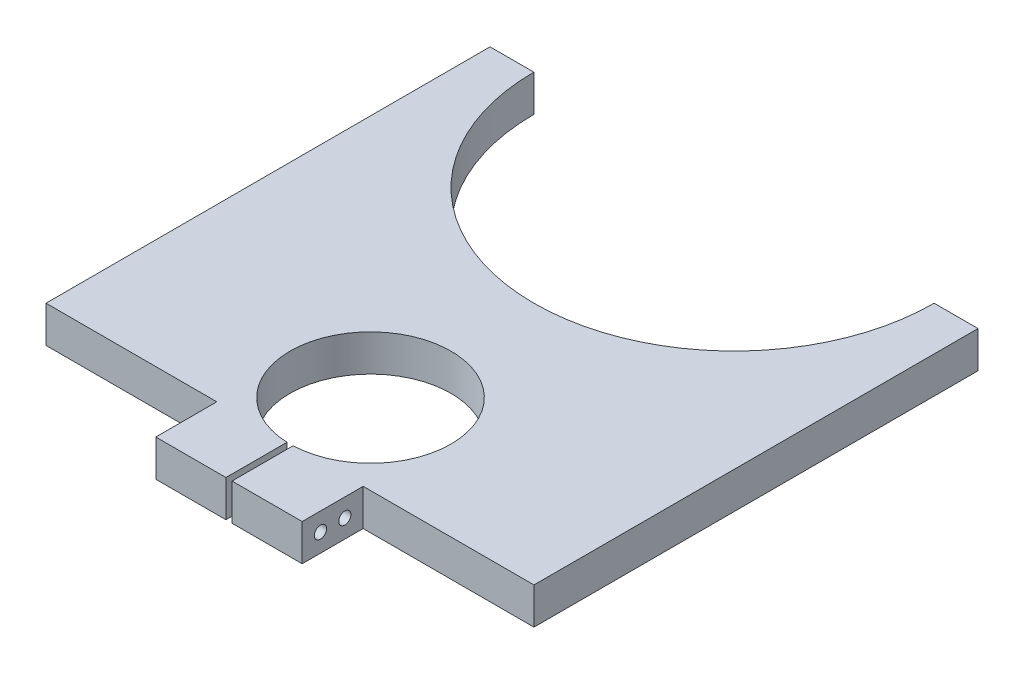
ISO-10303-21;
HEADER;
FILE_DESCRIPTION(('STEP AP214'),'2;1');
FILE_NAME('part.step','',(''),(''),'','','');
FILE_SCHEMA(('AUTOMOTIVE_DESIGN { 1 0 10303 214 1 1 1 1 }'));
ENDSEC;
DATA;
#1=APPLICATION_CONTEXT('core data for automotive mechanical design processes');
#2=APPLICATION_PROTOCOL_DEFINITION('international standard','automotive_design',2000,#1);
#3=PRODUCT_CONTEXT('',#1,'mechanical');
#4=PRODUCT('Part','Part','',(#3));
#5=PRODUCT_RELATED_PRODUCT_CATEGORY('part','',(#4));
#6=PRODUCT_DEFINITION_FORMATION('','',#4);
#7=PRODUCT_DEFINITION_CONTEXT('part definition',#1,'design');
#8=PRODUCT_DEFINITION('design','',#6,#7);
#9=PRODUCT_DEFINITION_SHAPE('','',#8);
#10=(LENGTH_UNIT() NAMED_UNIT(*) SI_UNIT(.MILLI.,.METRE.));
#11=(NAMED_UNIT(*) PLANE_ANGLE_UNIT() SI_UNIT($,.RADIAN.));
#12=(NAMED_UNIT(*) SI_UNIT($,.STERADIAN.) SOLID_ANGLE_UNIT());
#13=UNCERTAINTY_MEASURE_WITH_UNIT(LENGTH_MEASURE(1.E-05),#10,'distance_accuracy_value','');
#14=(GEOMETRIC_REPRESENTATION_CONTEXT(3) GLOBAL_UNCERTAINTY_ASSIGNED_CONTEXT((#13)) GLOBAL_UNIT_ASSIGNED_CONTEXT((#10,
#11,#12)) REPRESENTATION_CONTEXT('',''));
#15=CARTESIAN_POINT('',(0.,0.,0.));
#16=DIRECTION('',(0.,0.,1.));
#17=DIRECTION('',(1.,0.,0.));
#18=AXIS2_PLACEMENT_3D('',#15,#16,#17);
#19=CARTESIAN_POINT('',(127.,9.525,0.));
#20=DIRECTION('',(0.,0.,1.));
#21=DIRECTION('',(1.,0.,0.));
#22=AXIS2_PLACEMENT_3D('',#19,#20,#21);
#23=PLANE('',#22);
#24=DIRECTION('',(-1.,0.,0.));
#25=VECTOR('',#24,1.);
#26=CARTESIAN_POINT('',(127.,0.,0.));
#27=LINE('',#26,#25);
#28=CARTESIAN_POINT('',(127.,0.,0.));
#29=VERTEX_POINT('',#28);
#30=CARTESIAN_POINT('',(115.58524,0.,0.));
#31=VERTEX_POINT('',#30);
#32=EDGE_CURVE('E154',#29,#31,#27,.T.);
#33=ORIENTED_EDGE('',*,*,#32,.T.);
#34=DIRECTION('',(0.,1.,0.));
#35=VECTOR('',#34,1.);
#36=CARTESIAN_POINT('',(115.58524,0.,0.));
#37=LINE('',#36,#35);
#38=CARTESIAN_POINT('',(115.58524,9.525,0.));
#39=VERTEX_POINT('',#38);
#40=EDGE_CURVE('E49',#31,#39,#37,.T.);
#41=ORIENTED_EDGE('',*,*,#40,.T.);
#42=DIRECTION('',(-1.,0.,0.));
#43=VECTOR('',#42,1.);
#44=CARTESIAN_POINT('',(127.,9.525,0.));
#45=LINE('',#44,#43);
#46=CARTESIAN_POINT('',(127.,9.525,0.));
#47=VERTEX_POINT('',#46);
#48=EDGE_CURVE('E255',#47,#39,#45,.T.);
#49=ORIENTED_EDGE('',*,*,#48,.F.);
#50=DIRECTION('',(0.,-1.,0.));
#51=VECTOR('',#50,1.);
#52=CARTESIAN_POINT('',(127.,9.525,0.));
#53=LINE('',#52,#51);
#54=EDGE_CURVE('E41',#47,#29,#53,.T.);
#55=ORIENTED_EDGE('',*,*,#54,.T.);
#56=EDGE_LOOP('',(#33,#41,#49,#55));
#57=FACE_BOUND('',#56,.T.);
#58=ADVANCED_FACE('F32',(#57),#23,.F.);
#59=CARTESIAN_POINT('',(0.,9.525,131.445));
#60=DIRECTION('',(0.,0.,-1.));
#61=DIRECTION('',(-1.,0.,0.));
#62=AXIS2_PLACEMENT_3D('',#59,#60,#61);
#63=PLANE('',#62);
#64=DIRECTION('',(1.,0.,0.));
#65=VECTOR('',#64,1.);
#66=CARTESIAN_POINT('',(0.,0.,131.445));
#67=LINE('',#66,#65);
#68=CARTESIAN_POINT('',(44.45,0.,131.445));
#69=VERTEX_POINT('',#68);
#70=CARTESIAN_POINT('',(62.70625,0.,131.445));
#71=VERTEX_POINT('',#70);
#72=EDGE_CURVE('E166',#69,#71,#67,.T.);
#73=ORIENTED_EDGE('',*,*,#72,.T.);
#74=DIRECTION('',(0.,1.,0.));
#75=VECTOR('',#74,1.);
#76=CARTESIAN_POINT('',(62.70625,0.,131.445));
#77=LINE('',#76,#75);
#78=CARTESIAN_POINT('',(62.70625,9.525,131.445));
#79=VERTEX_POINT('',#78);
#80=EDGE_CURVE('E215',#71,#79,#77,.T.);
#81=ORIENTED_EDGE('',*,*,#80,.T.);
#82=DIRECTION('',(1.,0.,0.));
#83=VECTOR('',#82,1.);
#84=CARTESIAN_POINT('',(0.,9.525,131.445));
#85=LINE('',#84,#83);
#86=CARTESIAN_POINT('',(44.45,9.525,131.445));
#87=VERTEX_POINT('',#86);
#88=EDGE_CURVE('E261',#87,#79,#85,.T.);
#89=ORIENTED_EDGE('',*,*,#88,.F.);
#90=DIRECTION('',(0.,1.,0.));
#91=VECTOR('',#90,1.);
#92=CARTESIAN_POINT('',(44.45,0.,131.445));
#93=LINE('',#92,#91);
#94=EDGE_CURVE('E230',#69,#87,#93,.T.);
#95=ORIENTED_EDGE('',*,*,#94,.F.);
#96=EDGE_LOOP('',(#73,#81,#89,#95));
#97=FACE_BOUND('',#96,.T.);
#98=ADVANCED_FACE('F303',(#97),#63,.F.);
#99=CARTESIAN_POINT('',(11.41476,9.525,0.));
#100=VERTEX_POINT('',#99);
#101=CARTESIAN_POINT('',(0.,9.525,0.));
#102=VERTEX_POINT('',#101);
#103=EDGE_CURVE('E148',#100,#102,#45,.T.);
#104=ORIENTED_EDGE('',*,*,#103,.F.);
#105=DIRECTION('',(0.,1.,0.));
#106=VECTOR('',#105,1.);
#107=CARTESIAN_POINT('',(11.41476,0.,0.));
#108=LINE('',#107,#106);
#109=CARTESIAN_POINT('',(11.41476,0.,0.));
#110=VERTEX_POINT('',#109);
#111=EDGE_CURVE('E135',#110,#100,#108,.T.);
#112=ORIENTED_EDGE('',*,*,#111,.F.);
#113=CARTESIAN_POINT('',(0.,0.,0.));
#114=VERTEX_POINT('',#113);
#115=EDGE_CURVE('E146',#110,#114,#27,.T.);
#116=ORIENTED_EDGE('',*,*,#115,.T.);
#117=DIRECTION('',(0.,-1.,0.));
#118=VECTOR('',#117,1.);
#119=CARTESIAN_POINT('',(0.,9.525,0.));
#120=LINE('',#119,#118);
#121=EDGE_CURVE('E11',#102,#114,#120,.T.);
#122=ORIENTED_EDGE('',*,*,#121,.F.);
#123=EDGE_LOOP('',(#104,#112,#116,#122));
#124=FACE_BOUND('',#123,.T.);
#125=ADVANCED_FACE('F34',(#124),#23,.F.);
#126=CARTESIAN_POINT('',(0.,9.525,0.));
#127=DIRECTION('',(1.,0.,0.));
#128=DIRECTION('',(0.,0.,-1.));
#129=AXIS2_PLACEMENT_3D('',#126,#127,#128);
#130=PLANE('',#129);
#131=DIRECTION('',(0.,0.,1.));
#132=VECTOR('',#131,1.);
#133=CARTESIAN_POINT('',(0.,0.,0.));
#134=LINE('',#133,#132);
#135=CARTESIAN_POINT('',(0.,0.,115.57));
#136=VERTEX_POINT('',#135);
#137=EDGE_CURVE('E153',#114,#136,#134,.T.);
#138=ORIENTED_EDGE('',*,*,#137,.T.);
#139=DIRECTION('',(0.,1.,0.));
#140=VECTOR('',#139,1.);
#141=CARTESIAN_POINT('',(0.,0.,115.57));
#142=LINE('',#141,#140);
#143=CARTESIAN_POINT('',(0.,9.525,115.57));
#144=VERTEX_POINT('',#143);
#145=EDGE_CURVE('E155',#136,#144,#142,.T.);
#146=ORIENTED_EDGE('',*,*,#145,.T.);
#147=DIRECTION('',(0.,0.,1.));
#148=VECTOR('',#147,1.);
#149=CARTESIAN_POINT('',(0.,9.525,0.));
#150=LINE('',#149,#148);
#151=EDGE_CURVE('E258',#102,#144,#150,.T.);
#152=ORIENTED_EDGE('',*,*,#151,.F.);
#153=ORIENTED_EDGE('',*,*,#121,.T.);
#154=EDGE_LOOP('',(#138,#146,#152,#153));
#155=FACE_BOUND('',#154,.T.);
#156=ADVANCED_FACE('F294',(#155),#130,.F.);
#157=CARTESIAN_POINT('',(64.29375,9.525,131.445));
#158=VERTEX_POINT('',#157);
#159=CARTESIAN_POINT('',(82.55,9.525,131.445));
#160=VERTEX_POINT('',#159);
#161=EDGE_CURVE('E260',#158,#160,#85,.T.);
#162=ORIENTED_EDGE('',*,*,#161,.F.);
#163=DIRECTION('',(0.,1.,0.));
#164=VECTOR('',#163,1.);
#165=CARTESIAN_POINT('',(64.29375,0.,131.445));
#166=LINE('',#165,#164);
#167=CARTESIAN_POINT('',(64.29375,0.,131.445));
#168=VERTEX_POINT('',#167);
#169=EDGE_CURVE('E208',#168,#158,#166,.T.);
#170=ORIENTED_EDGE('',*,*,#169,.F.);
#171=CARTESIAN_POINT('',(82.55,0.,131.445));
#172=VERTEX_POINT('',#171);
#173=EDGE_CURVE('E165',#168,#172,#67,.T.);
#174=ORIENTED_EDGE('',*,*,#173,.T.);
#175=DIRECTION('',(0.,1.,0.));
#176=VECTOR('',#175,1.);
#177=CARTESIAN_POINT('',(82.55,0.,131.445));
#178=LINE('',#177,#176);
#179=EDGE_CURVE('E234',#172,#160,#178,.T.);
#180=ORIENTED_EDGE('',*,*,#179,.T.);
#181=EDGE_LOOP('',(#162,#170,#174,#180));
#182=FACE_BOUND('',#181,.T.);
#183=ADVANCED_FACE('F279',(#182),#63,.F.);
#184=CARTESIAN_POINT('',(127.,9.525,131.445));
#185=DIRECTION('',(-1.,0.,0.));
#186=DIRECTION('',(0.,0.,1.));
#187=AXIS2_PLACEMENT_3D('',#184,#185,#186);
#188=PLANE('',#187);
#189=DIRECTION('',(0.,0.,-1.));
#190=VECTOR('',#189,1.);
#191=CARTESIAN_POINT('',(127.,9.525,131.445));
#192=LINE('',#191,#190);
#193=CARTESIAN_POINT('',(127.,9.525,115.57));
#194=VERTEX_POINT('',#193);
#195=EDGE_CURVE('E162',#194,#47,#192,.T.);
#196=ORIENTED_EDGE('',*,*,#195,.F.);
#197=DIRECTION('',(0.,1.,0.));
#198=VECTOR('',#197,1.);
#199=CARTESIAN_POINT('',(127.,0.,115.57));
#200=LINE('',#199,#198);
#201=CARTESIAN_POINT('',(127.,0.,115.57));
#202=VERTEX_POINT('',#201);
#203=EDGE_CURVE('E245',#202,#194,#200,.T.);
#204=ORIENTED_EDGE('',*,*,#203,.F.);
#205=DIRECTION('',(0.,0.,-1.));
#206=VECTOR('',#205,1.);
#207=CARTESIAN_POINT('',(127.,0.,131.445));
#208=LINE('',#207,#206);
#209=EDGE_CURVE('E169',#202,#29,#208,.T.);
#210=ORIENTED_EDGE('',*,*,#209,.T.);
#211=ORIENTED_EDGE('',*,*,#54,.F.);
#212=EDGE_LOOP('',(#196,#204,#210,#211));
#213=FACE_BOUND('',#212,.T.);
#214=ADVANCED_FACE('F288',(#213),#188,.F.);
#215=CARTESIAN_POINT('',(0.,9.525,0.));
#216=DIRECTION('',(0.,1.,0.));
#217=DIRECTION('',(0.,0.,1.));
#218=AXIS2_PLACEMENT_3D('',#215,#216,#217);
#219=PLANE('',#218);
#220=CARTESIAN_POINT('',(63.5,9.525,0.));
#221=DIRECTION('',(0.,1.,0.));
#222=DIRECTION('',(0.,0.,1.));
#223=AXIS2_PLACEMENT_3D('',#220,#221,#222);
#224=CIRCLE('',#223,52.08524);
#225=EDGE_CURVE('E141',#100,#39,#224,.T.);
#226=ORIENTED_EDGE('',*,*,#225,.F.);
#227=ORIENTED_EDGE('',*,*,#103,.T.);
#228=ORIENTED_EDGE('',*,*,#151,.T.);
#229=DIRECTION('',(-1.,0.,0.));
#230=VECTOR('',#229,1.);
#231=CARTESIAN_POINT('',(44.45,9.525,115.57));
#232=LINE('',#231,#230);
#233=CARTESIAN_POINT('',(44.45,9.525,115.57));
#234=VERTEX_POINT('',#233);
#235=EDGE_CURVE('E228',#234,#144,#232,.T.);
#236=ORIENTED_EDGE('',*,*,#235,.F.);
#237=DIRECTION('',(0.,0.,-1.));
#238=VECTOR('',#237,1.);
#239=CARTESIAN_POINT('',(44.45,9.525,131.445));
#240=LINE('',#239,#238);
#241=EDGE_CURVE('E231',#87,#234,#240,.T.);
#242=ORIENTED_EDGE('',*,*,#241,.F.);
#243=ORIENTED_EDGE('',*,*,#88,.T.);
#244=DIRECTION('',(0.,0.,1.));
#245=VECTOR('',#244,1.);
#246=CARTESIAN_POINT('',(62.70625,9.525,131.445));
#247=LINE('',#246,#245);
#248=CARTESIAN_POINT('',(62.70625,9.525,115.55496145979));
#249=VERTEX_POINT('',#248);
#250=EDGE_CURVE('E203',#249,#79,#247,.T.);
#251=ORIENTED_EDGE('',*,*,#250,.F.);
#252=CARTESIAN_POINT('',(63.5,9.525,94.615));
#253=DIRECTION('',(0.,1.,0.));
#254=DIRECTION('',(0.,0.,1.));
#255=AXIS2_PLACEMENT_3D('',#252,#253,#254);
#256=CIRCLE('',#255,20.955);
#257=CARTESIAN_POINT('',(64.29375,9.525,115.55496145979));
#258=VERTEX_POINT('',#257);
#259=EDGE_CURVE('E211',#258,#249,#256,.T.);
#260=ORIENTED_EDGE('',*,*,#259,.F.);
#261=DIRECTION('',(0.,0.,-1.));
#262=VECTOR('',#261,1.);
#263=CARTESIAN_POINT('',(64.29375,9.525,115.57));
#264=LINE('',#263,#262);
#265=EDGE_CURVE('E198',#158,#258,#264,.T.);
#266=ORIENTED_EDGE('',*,*,#265,.F.);
#267=ORIENTED_EDGE('',*,*,#161,.T.);
#268=DIRECTION('',(0.,0.,1.));
#269=VECTOR('',#268,1.);
#270=CARTESIAN_POINT('',(82.55,9.525,131.445));
#271=LINE('',#270,#269);
#272=CARTESIAN_POINT('',(82.55,9.525,115.57));
#273=VERTEX_POINT('',#272);
#274=EDGE_CURVE('E242',#273,#160,#271,.T.);
#275=ORIENTED_EDGE('',*,*,#274,.F.);
#276=DIRECTION('',(-1.,0.,0.));
#277=VECTOR('',#276,1.);
#278=CARTESIAN_POINT('',(82.55,9.525,115.57));
#279=LINE('',#278,#277);
#280=EDGE_CURVE('E218',#194,#273,#279,.T.);
#281=ORIENTED_EDGE('',*,*,#280,.F.);
#282=ORIENTED_EDGE('',*,*,#195,.T.);
#283=ORIENTED_EDGE('',*,*,#48,.T.);
#284=EDGE_LOOP('',(#226,#227,#228,#236,#242,#243,#251,#260,#266,#267,#275,#281,#282,#283));
#285=FACE_BOUND('',#284,.T.);
#286=ADVANCED_FACE('F270',(#285),#219,.T.);
#287=CARTESIAN_POINT('',(0.,0.,0.));
#288=DIRECTION('',(0.,1.,0.));
#289=DIRECTION('',(0.,0.,1.));
#290=AXIS2_PLACEMENT_3D('',#287,#288,#289);
#291=PLANE('',#290);
#292=ORIENTED_EDGE('',*,*,#115,.F.);
#293=CARTESIAN_POINT('',(63.5,0.,0.));
#294=DIRECTION('',(0.,1.,0.));
#295=DIRECTION('',(0.,0.,1.));
#296=AXIS2_PLACEMENT_3D('',#293,#294,#295);
#297=CIRCLE('',#296,52.08524);
#298=EDGE_CURVE('E132',#110,#31,#297,.T.);
#299=ORIENTED_EDGE('',*,*,#298,.T.);
#300=ORIENTED_EDGE('',*,*,#32,.F.);
#301=ORIENTED_EDGE('',*,*,#209,.F.);
#302=DIRECTION('',(-1.,0.,0.));
#303=VECTOR('',#302,1.);
#304=CARTESIAN_POINT('',(82.55,0.,115.57));
#305=LINE('',#304,#303);
#306=CARTESIAN_POINT('',(82.55,0.,115.57));
#307=VERTEX_POINT('',#306);
#308=EDGE_CURVE('E238',#202,#307,#305,.T.);
#309=ORIENTED_EDGE('',*,*,#308,.T.);
#310=DIRECTION('',(0.,0.,1.));
#311=VECTOR('',#310,1.);
#312=CARTESIAN_POINT('',(82.55,0.,131.445));
#313=LINE('',#312,#311);
#314=EDGE_CURVE('E241',#307,#172,#313,.T.);
#315=ORIENTED_EDGE('',*,*,#314,.T.);
#316=ORIENTED_EDGE('',*,*,#173,.F.);
#317=DIRECTION('',(0.,0.,-1.));
#318=VECTOR('',#317,1.);
#319=CARTESIAN_POINT('',(64.29375,0.,115.57));
#320=LINE('',#319,#318);
#321=CARTESIAN_POINT('',(64.29375,0.,115.55496145979));
#322=VERTEX_POINT('',#321);
#323=EDGE_CURVE('E200',#168,#322,#320,.T.);
#324=ORIENTED_EDGE('',*,*,#323,.T.);
#325=CARTESIAN_POINT('',(63.5,0.,94.615));
#326=DIRECTION('',(0.,1.,0.));
#327=DIRECTION('',(0.,0.,1.));
#328=AXIS2_PLACEMENT_3D('',#325,#326,#327);
#329=CIRCLE('',#328,20.955);
#330=CARTESIAN_POINT('',(62.70625,0.,115.55496145979));
#331=VERTEX_POINT('',#330);
#332=EDGE_CURVE('E57',#322,#331,#329,.T.);
#333=ORIENTED_EDGE('',*,*,#332,.T.);
#334=DIRECTION('',(0.,0.,1.));
#335=VECTOR('',#334,1.);
#336=CARTESIAN_POINT('',(62.70625,0.,115.57));
#337=LINE('',#336,#335);
#338=EDGE_CURVE('E205',#331,#71,#337,.T.);
#339=ORIENTED_EDGE('',*,*,#338,.T.);
#340=ORIENTED_EDGE('',*,*,#72,.F.);
#341=DIRECTION('',(0.,0.,-1.));
#342=VECTOR('',#341,1.);
#343=CARTESIAN_POINT('',(44.45,0.,131.445));
#344=LINE('',#343,#342);
#345=CARTESIAN_POINT('',(44.45,0.,115.57));
#346=VERTEX_POINT('',#345);
#347=EDGE_CURVE('E224',#69,#346,#344,.T.);
#348=ORIENTED_EDGE('',*,*,#347,.T.);
#349=DIRECTION('',(-1.,0.,0.));
#350=VECTOR('',#349,1.);
#351=CARTESIAN_POINT('',(44.45,0.,115.57));
#352=LINE('',#351,#350);
#353=EDGE_CURVE('E227',#346,#136,#352,.T.);
#354=ORIENTED_EDGE('',*,*,#353,.T.);
#355=ORIENTED_EDGE('',*,*,#137,.F.);
#356=EDGE_LOOP('',(#292,#299,#300,#301,#309,#315,#316,#324,#333,#339,#340,#348,#354,#355));
#357=FACE_BOUND('',#356,.T.);
#358=ADVANCED_FACE('F150',(#357),#291,.F.);
#359=CARTESIAN_POINT('',(82.55,0.,131.445));
#360=DIRECTION('',(-1.,0.,0.));
#361=DIRECTION('',(0.,0.,1.));
#362=AXIS2_PLACEMENT_3D('',#359,#360,#361);
#363=PLANE('',#362);
#364=CARTESIAN_POINT('',(82.55,4.7625,120.3325));
#365=DIRECTION('',(-1.,0.,0.));
#366=DIRECTION('',(0.,0.,1.));
#367=AXIS2_PLACEMENT_3D('',#364,#365,#366);
#368=CIRCLE('',#367,1.5875);
#369=CARTESIAN_POINT('',(82.55,4.7625,121.92));
#370=VERTEX_POINT('',#369);
#371=EDGE_CURVE('E194',#370,#370,#368,.T.);
#372=ORIENTED_EDGE('',*,*,#371,.T.);
#373=EDGE_LOOP('',(#372));
#374=FACE_BOUND('',#373,.T.);
#375=CARTESIAN_POINT('',(82.55,4.7625,126.6825));
#376=DIRECTION('',(-1.,0.,0.));
#377=DIRECTION('',(0.,0.,1.));
#378=AXIS2_PLACEMENT_3D('',#375,#376,#377);
#379=CIRCLE('',#378,1.58749999999999);
#380=CARTESIAN_POINT('',(82.55,4.7625,128.27));
#381=VERTEX_POINT('',#380);
#382=EDGE_CURVE('E179',#381,#381,#379,.T.);
#383=ORIENTED_EDGE('',*,*,#382,.T.);
#384=EDGE_LOOP('',(#383));
#385=FACE_BOUND('',#384,.T.);
#386=ORIENTED_EDGE('',*,*,#274,.T.);
#387=ORIENTED_EDGE('',*,*,#179,.F.);
#388=ORIENTED_EDGE('',*,*,#314,.F.);
#389=DIRECTION('',(0.,1.,0.));
#390=VECTOR('',#389,1.);
#391=CARTESIAN_POINT('',(82.55,0.,115.57));
#392=LINE('',#391,#390);
#393=EDGE_CURVE('E252',#307,#273,#392,.T.);
#394=ORIENTED_EDGE('',*,*,#393,.T.);
#395=EDGE_LOOP('',(#386,#387,#388,#394));
#396=FACE_BOUND('',#395,.T.);
#397=ADVANCED_FACE('F277',(#374,#385,#396),#363,.F.);
#398=CARTESIAN_POINT('',(82.55,0.,115.57));
#399=DIRECTION('',(0.,0.,-1.));
#400=DIRECTION('',(-1.,0.,0.));
#401=AXIS2_PLACEMENT_3D('',#398,#399,#400);
#402=PLANE('',#401);
#403=ORIENTED_EDGE('',*,*,#280,.T.);
#404=ORIENTED_EDGE('',*,*,#393,.F.);
#405=ORIENTED_EDGE('',*,*,#308,.F.);
#406=ORIENTED_EDGE('',*,*,#203,.T.);
#407=EDGE_LOOP('',(#403,#404,#405,#406));
#408=FACE_BOUND('',#407,.T.);
#409=ADVANCED_FACE('F283',(#408),#402,.F.);
#410=CARTESIAN_POINT('',(44.45,0.,115.57));
#411=DIRECTION('',(0.,0.,-1.));
#412=DIRECTION('',(-1.,0.,0.));
#413=AXIS2_PLACEMENT_3D('',#410,#411,#412);
#414=PLANE('',#413);
#415=ORIENTED_EDGE('',*,*,#235,.T.);
#416=ORIENTED_EDGE('',*,*,#145,.F.);
#417=ORIENTED_EDGE('',*,*,#353,.F.);
#418=DIRECTION('',(0.,1.,0.));
#419=VECTOR('',#418,1.);
#420=CARTESIAN_POINT('',(44.45,0.,115.57));
#421=LINE('',#420,#419);
#422=EDGE_CURVE('E158',#346,#234,#421,.T.);
#423=ORIENTED_EDGE('',*,*,#422,.T.);
#424=EDGE_LOOP('',(#415,#416,#417,#423));
#425=FACE_BOUND('',#424,.T.);
#426=ADVANCED_FACE('F296',(#425),#414,.F.);
#427=CARTESIAN_POINT('',(44.45,0.,131.445));
#428=DIRECTION('',(1.,0.,0.));
#429=DIRECTION('',(0.,0.,-1.));
#430=AXIS2_PLACEMENT_3D('',#427,#428,#429);
#431=PLANE('',#430);
#432=CARTESIAN_POINT('',(44.45,4.7625,120.3325));
#433=DIRECTION('',(-1.,0.,0.));
#434=DIRECTION('',(0.,0.,1.));
#435=AXIS2_PLACEMENT_3D('',#432,#433,#434);
#436=CIRCLE('',#435,1.5875);
#437=CARTESIAN_POINT('',(44.45,4.7625,121.92));
#438=VERTEX_POINT('',#437);
#439=EDGE_CURVE('E175',#438,#438,#436,.T.);
#440=ORIENTED_EDGE('',*,*,#439,.F.);
#441=EDGE_LOOP('',(#440));
#442=FACE_BOUND('',#441,.T.);
#443=CARTESIAN_POINT('',(44.45,4.7625,126.6825));
#444=DIRECTION('',(-1.,0.,0.));
#445=DIRECTION('',(0.,0.,1.));
#446=AXIS2_PLACEMENT_3D('',#443,#444,#445);
#447=CIRCLE('',#446,1.58749999999999);
#448=CARTESIAN_POINT('',(44.45,4.7625,128.27));
#449=VERTEX_POINT('',#448);
#450=EDGE_CURVE('E182',#449,#449,#447,.T.);
#451=ORIENTED_EDGE('',*,*,#450,.F.);
#452=EDGE_LOOP('',(#451));
#453=FACE_BOUND('',#452,.T.);
#454=ORIENTED_EDGE('',*,*,#241,.T.);
#455=ORIENTED_EDGE('',*,*,#422,.F.);
#456=ORIENTED_EDGE('',*,*,#347,.F.);
#457=ORIENTED_EDGE('',*,*,#94,.T.);
#458=EDGE_LOOP('',(#454,#455,#456,#457));
#459=FACE_BOUND('',#458,.T.);
#460=ADVANCED_FACE('F301',(#442,#453,#459),#431,.F.);
#461=CARTESIAN_POINT('',(62.70625,0.,131.445));
#462=DIRECTION('',(-1.,0.,0.));
#463=DIRECTION('',(0.,0.,1.));
#464=AXIS2_PLACEMENT_3D('',#461,#462,#463);
#465=PLANE('',#464);
#466=CARTESIAN_POINT('',(62.70625,4.7625,120.3325));
#467=DIRECTION('',(-1.,0.,0.));
#468=DIRECTION('',(0.,0.,1.));
#469=AXIS2_PLACEMENT_3D('',#466,#467,#468);
#470=CIRCLE('',#469,1.5875);
#471=CARTESIAN_POINT('',(62.70625,4.7625,121.92));
#472=VERTEX_POINT('',#471);
#473=EDGE_CURVE('E191',#472,#472,#470,.T.);
#474=ORIENTED_EDGE('',*,*,#473,.T.);
#475=EDGE_LOOP('',(#474));
#476=FACE_BOUND('',#475,.T.);
#477=CARTESIAN_POINT('',(62.70625,4.7625,126.6825));
#478=DIRECTION('',(-1.,0.,0.));
#479=DIRECTION('',(0.,0.,1.));
#480=AXIS2_PLACEMENT_3D('',#477,#478,#479);
#481=CIRCLE('',#480,1.58749999999999);
#482=CARTESIAN_POINT('',(62.70625,4.7625,128.27));
#483=VERTEX_POINT('',#482);
#484=EDGE_CURVE('E174',#483,#483,#481,.T.);
#485=ORIENTED_EDGE('',*,*,#484,.T.);
#486=EDGE_LOOP('',(#485));
#487=FACE_BOUND('',#486,.T.);
#488=ORIENTED_EDGE('',*,*,#250,.T.);
#489=ORIENTED_EDGE('',*,*,#80,.F.);
#490=ORIENTED_EDGE('',*,*,#338,.F.);
#491=DIRECTION('',(0.,1.,0.));
#492=VECTOR('',#491,1.);
#493=CARTESIAN_POINT('',(62.70625,0.,115.55496145979));
#494=LINE('',#493,#492);
#495=EDGE_CURVE('E219',#331,#249,#494,.T.);
#496=ORIENTED_EDGE('',*,*,#495,.T.);
#497=EDGE_LOOP('',(#488,#489,#490,#496));
#498=FACE_BOUND('',#497,.T.);
#499=ADVANCED_FACE('F306',(#476,#487,#498),#465,.F.);
#500=CARTESIAN_POINT('',(63.5,0.,94.615));
#501=DIRECTION('',(0.,1.,0.));
#502=DIRECTION('',(0.,0.,1.));
#503=AXIS2_PLACEMENT_3D('',#500,#501,#502);
#504=CYLINDRICAL_SURFACE('',#503,20.955);
#505=ORIENTED_EDGE('',*,*,#259,.T.);
#506=ORIENTED_EDGE('',*,*,#495,.F.);
#507=ORIENTED_EDGE('',*,*,#332,.F.);
#508=DIRECTION('',(0.,1.,0.));
#509=VECTOR('',#508,1.);
#510=CARTESIAN_POINT('',(64.29375,0.,115.55496145979));
#511=LINE('',#510,#509);
#512=EDGE_CURVE('E221',#322,#258,#511,.T.);
#513=ORIENTED_EDGE('',*,*,#512,.T.);
#514=EDGE_LOOP('',(#505,#506,#507,#513));
#515=FACE_BOUND('',#514,.T.);
#516=ADVANCED_FACE('F307',(#515),#504,.F.);
#517=CARTESIAN_POINT('',(64.29375,0.,115.57));
#518=DIRECTION('',(1.,0.,0.));
#519=DIRECTION('',(0.,0.,-1.));
#520=AXIS2_PLACEMENT_3D('',#517,#518,#519);
#521=PLANE('',#520);
#522=CARTESIAN_POINT('',(64.29375,4.7625,120.3325));
#523=DIRECTION('',(1.,0.,0.));
#524=DIRECTION('',(0.,0.,-1.));
#525=AXIS2_PLACEMENT_3D('',#522,#523,#524);
#526=CIRCLE('',#525,1.5875);
#527=CARTESIAN_POINT('',(64.29375,4.7625,118.745));
#528=VERTEX_POINT('',#527);
#529=EDGE_CURVE('E36',#528,#528,#526,.T.);
#530=ORIENTED_EDGE('',*,*,#529,.T.);
#531=EDGE_LOOP('',(#530));
#532=FACE_BOUND('',#531,.T.);
#533=CARTESIAN_POINT('',(64.29375,4.7625,126.6825));
#534=DIRECTION('',(1.,0.,0.));
#535=DIRECTION('',(0.,0.,-1.));
#536=AXIS2_PLACEMENT_3D('',#533,#534,#535);
#537=CIRCLE('',#536,1.58749999999999);
#538=CARTESIAN_POINT('',(64.29375,4.7625,125.095));
#539=VERTEX_POINT('',#538);
#540=EDGE_CURVE('E172',#539,#539,#537,.T.);
#541=ORIENTED_EDGE('',*,*,#540,.T.);
#542=EDGE_LOOP('',(#541));
#543=FACE_BOUND('',#542,.T.);
#544=ORIENTED_EDGE('',*,*,#265,.T.);
#545=ORIENTED_EDGE('',*,*,#512,.F.);
#546=ORIENTED_EDGE('',*,*,#323,.F.);
#547=ORIENTED_EDGE('',*,*,#169,.T.);
#548=EDGE_LOOP('',(#544,#545,#546,#547));
#549=FACE_BOUND('',#548,.T.);
#550=ADVANCED_FACE('F309',(#532,#543,#549),#521,.F.);
#551=CARTESIAN_POINT('',(63.5,0.,0.));
#552=DIRECTION('',(0.,1.,0.));
#553=DIRECTION('',(0.,0.,1.));
#554=AXIS2_PLACEMENT_3D('',#551,#552,#553);
#555=CYLINDRICAL_SURFACE('',#554,52.08524);
#556=ORIENTED_EDGE('',*,*,#225,.T.);
#557=ORIENTED_EDGE('',*,*,#40,.F.);
#558=ORIENTED_EDGE('',*,*,#298,.F.);
#559=ORIENTED_EDGE('',*,*,#111,.T.);
#560=EDGE_LOOP('',(#556,#557,#558,#559));
#561=FACE_BOUND('',#560,.T.);
#562=ADVANCED_FACE('F134',(#561),#555,.F.);
#563=CARTESIAN_POINT('',(127.,4.7625,126.6825));
#564=DIRECTION('',(-1.,0.,0.));
#565=DIRECTION('',(0.,0.,1.));
#566=AXIS2_PLACEMENT_3D('',#563,#564,#565);
#567=CYLINDRICAL_SURFACE('',#566,1.58749999999999);
#568=ORIENTED_EDGE('',*,*,#540,.F.);
#569=EDGE_LOOP('',(#568));
#570=FACE_BOUND('',#569,.T.);
#571=ORIENTED_EDGE('',*,*,#382,.F.);
#572=EDGE_LOOP('',(#571));
#573=FACE_BOUND('',#572,.T.);
#574=ADVANCED_FACE('F317',(#570,#573),#567,.F.);
#575=CARTESIAN_POINT('',(127.,4.7625,120.3325));
#576=DIRECTION('',(-1.,0.,0.));
#577=DIRECTION('',(0.,0.,1.));
#578=AXIS2_PLACEMENT_3D('',#575,#576,#577);
#579=CYLINDRICAL_SURFACE('',#578,1.5875);
#580=ORIENTED_EDGE('',*,*,#529,.F.);
#581=EDGE_LOOP('',(#580));
#582=FACE_BOUND('',#581,.T.);
#583=ORIENTED_EDGE('',*,*,#371,.F.);
#584=EDGE_LOOP('',(#583));
#585=FACE_BOUND('',#584,.T.);
#586=ADVANCED_FACE('F446',(#582,#585),#579,.F.);
#587=ORIENTED_EDGE('',*,*,#450,.T.);
#588=EDGE_LOOP('',(#587));
#589=FACE_BOUND('',#588,.T.);
#590=ORIENTED_EDGE('',*,*,#484,.F.);
#591=EDGE_LOOP('',(#590));
#592=FACE_BOUND('',#591,.T.);
#593=ADVANCED_FACE('F449',(#589,#592),#567,.F.);
#594=ORIENTED_EDGE('',*,*,#439,.T.);
#595=EDGE_LOOP('',(#594));
#596=FACE_BOUND('',#595,.T.);
#597=ORIENTED_EDGE('',*,*,#473,.F.);
#598=EDGE_LOOP('',(#597));
#599=FACE_BOUND('',#598,.T.);
#600=ADVANCED_FACE('F456',(#596,#599),#579,.F.);
#601=CLOSED_SHELL('',(#58,#98,#125,#156,#183,#214,#286,#358,#397,#409,#426,#460,#499,#516,#550,
#562,#574,#586,#593,#600));
#602=MANIFOLD_SOLID_BREP('B2',#601);
#603=ADVANCED_BREP_SHAPE_REPRESENTATION('',(#18,#602),#14);
#604=SHAPE_DEFINITION_REPRESENTATION(#9,#603);
ENDSEC;
END-ISO-10303-21;
